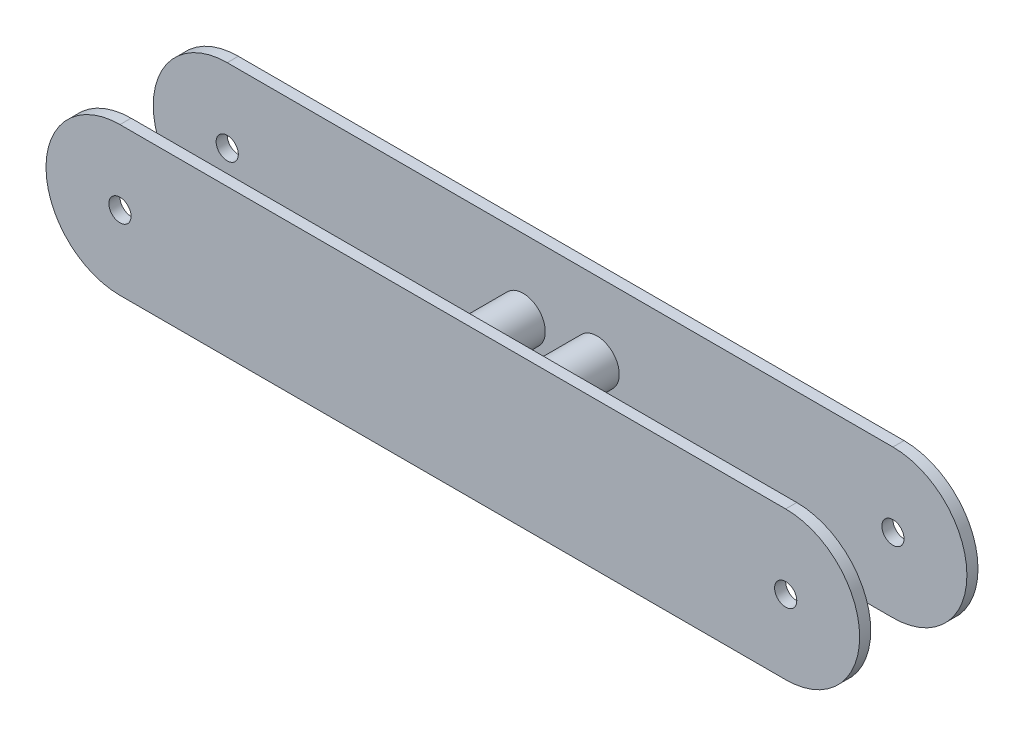
ISO-10303-21;
HEADER;
FILE_DESCRIPTION(('STEP AP214'),'2;1');
FILE_NAME('part.step','',(''),(''),'','','');
FILE_SCHEMA(('AUTOMOTIVE_DESIGN { 1 0 10303 214 1 1 1 1 }'));
ENDSEC;
DATA;
#1=APPLICATION_CONTEXT('core data for automotive mechanical design processes');
#2=APPLICATION_PROTOCOL_DEFINITION('international standard','automotive_design',2000,#1);
#3=PRODUCT_CONTEXT('',#1,'mechanical');
#4=PRODUCT('Part','Part','',(#3));
#5=PRODUCT_RELATED_PRODUCT_CATEGORY('part','',(#4));
#6=PRODUCT_DEFINITION_FORMATION('','',#4);
#7=PRODUCT_DEFINITION_CONTEXT('part definition',#1,'design');
#8=PRODUCT_DEFINITION('design','',#6,#7);
#9=PRODUCT_DEFINITION_SHAPE('','',#8);
#10=(LENGTH_UNIT() NAMED_UNIT(*) SI_UNIT(.MILLI.,.METRE.));
#11=(NAMED_UNIT(*) PLANE_ANGLE_UNIT() SI_UNIT($,.RADIAN.));
#12=(NAMED_UNIT(*) SI_UNIT($,.STERADIAN.) SOLID_ANGLE_UNIT());
#13=UNCERTAINTY_MEASURE_WITH_UNIT(LENGTH_MEASURE(1.E-05),#10,'distance_accuracy_value','');
#14=(GEOMETRIC_REPRESENTATION_CONTEXT(3) GLOBAL_UNCERTAINTY_ASSIGNED_CONTEXT((#13)) GLOBAL_UNIT_ASSIGNED_CONTEXT((#10,
#11,#12)) REPRESENTATION_CONTEXT('',''));
#15=CARTESIAN_POINT('',(0.,0.,0.));
#16=DIRECTION('',(0.,0.,1.));
#17=DIRECTION('',(1.,0.,0.));
#18=AXIS2_PLACEMENT_3D('',#15,#16,#17);
#19=CARTESIAN_POINT('',(36.2548733893554,-7.90045658926347,16.));
#20=DIRECTION('',(0.,0.,-1.));
#21=DIRECTION('',(-1.,0.,0.));
#22=AXIS2_PLACEMENT_3D('',#19,#20,#21);
#23=CYLINDRICAL_SURFACE('',#22,3.);
#24=CARTESIAN_POINT('',(36.2548733893554,-7.90045658926347,1.5));
#25=DIRECTION('',(0.,0.,-1.));
#26=DIRECTION('',(-1.,0.,0.));
#27=AXIS2_PLACEMENT_3D('',#24,#25,#26);
#28=CIRCLE('',#27,3.);
#29=CARTESIAN_POINT('',(33.2548733893554,-7.90045658926347,1.5));
#30=VERTEX_POINT('',#29);
#31=EDGE_CURVE('E173',#30,#30,#28,.T.);
#32=ORIENTED_EDGE('',*,*,#31,.F.);
#33=EDGE_LOOP('',(#32));
#34=FACE_BOUND('',#33,.T.);
#35=CARTESIAN_POINT('',(36.2548733893554,-7.90045658926347,14.5));
#36=DIRECTION('',(0.,0.,1.));
#37=DIRECTION('',(1.,0.,0.));
#38=AXIS2_PLACEMENT_3D('',#35,#36,#37);
#39=CIRCLE('',#38,3.);
#40=CARTESIAN_POINT('',(39.2548733893554,-7.90045658926347,14.5));
#41=VERTEX_POINT('',#40);
#42=EDGE_CURVE('E44',#41,#41,#39,.F.);
#43=ORIENTED_EDGE('',*,*,#42,.T.);
#44=EDGE_LOOP('',(#43));
#45=FACE_BOUND('',#44,.T.);
#46=ADVANCED_FACE('F40',(#34,#45),#23,.T.);
#47=CARTESIAN_POINT('',(-3.74512661064462,-7.90045658926347,16.));
#48=DIRECTION('',(0.,0.,-1.));
#49=DIRECTION('',(-1.,0.,0.));
#50=AXIS2_PLACEMENT_3D('',#47,#48,#49);
#51=CYLINDRICAL_SURFACE('',#50,10.);
#52=DIRECTION('',(0.,0.,-1.));
#53=VECTOR('',#52,1.);
#54=CARTESIAN_POINT('',(-3.74512661064462,-17.9004565892635,16.));
#55=LINE('',#54,#53);
#56=CARTESIAN_POINT('',(-3.74512661064462,-17.9004565892635,1.5));
#57=VERTEX_POINT('',#56);
#58=CARTESIAN_POINT('',(-3.74512661064462,-17.9004565892635,0.));
#59=VERTEX_POINT('',#58);
#60=EDGE_CURVE('E163',#57,#59,#55,.T.);
#61=ORIENTED_EDGE('',*,*,#60,.F.);
#62=CARTESIAN_POINT('',(-3.74512661064462,-7.90045658926347,1.5));
#63=DIRECTION('',(0.,0.,-1.));
#64=DIRECTION('',(-1.,0.,0.));
#65=AXIS2_PLACEMENT_3D('',#62,#63,#64);
#66=CIRCLE('',#65,10.);
#67=CARTESIAN_POINT('',(-3.74512661064462,2.09954341073653,1.5));
#68=VERTEX_POINT('',#67);
#69=EDGE_CURVE('E57',#57,#68,#66,.T.);
#70=ORIENTED_EDGE('',*,*,#69,.T.);
#71=DIRECTION('',(0.,0.,-1.));
#72=VECTOR('',#71,1.);
#73=CARTESIAN_POINT('',(-3.74512661064462,2.09954341073653,16.));
#74=LINE('',#73,#72);
#75=CARTESIAN_POINT('',(-3.74512661064462,2.09954341073653,0.));
#76=VERTEX_POINT('',#75);
#77=EDGE_CURVE('E167',#68,#76,#74,.T.);
#78=ORIENTED_EDGE('',*,*,#77,.T.);
#79=CARTESIAN_POINT('',(-3.74512661064462,-7.90045658926347,0.));
#80=DIRECTION('',(0.,0.,1.));
#81=DIRECTION('',(1.,0.,0.));
#82=AXIS2_PLACEMENT_3D('',#79,#80,#81);
#83=CIRCLE('',#82,10.);
#84=EDGE_CURVE('E164',#76,#59,#83,.T.);
#85=ORIENTED_EDGE('',*,*,#84,.T.);
#86=EDGE_LOOP('',(#61,#70,#78,#85));
#87=FACE_BOUND('',#86,.T.);
#88=ADVANCED_FACE('F235',(#87),#51,.T.);
#89=CARTESIAN_POINT('',(0.,-17.9004565892635,16.));
#90=DIRECTION('',(0.,1.,0.));
#91=DIRECTION('',(0.,0.,1.));
#92=AXIS2_PLACEMENT_3D('',#89,#90,#91);
#93=PLANE('',#92);
#94=DIRECTION('',(0.,0.,-1.));
#95=VECTOR('',#94,1.);
#96=CARTESIAN_POINT('',(86.2548733893554,-17.9004565892635,16.));
#97=LINE('',#96,#95);
#98=CARTESIAN_POINT('',(86.2548733893554,-17.9004565892635,1.5));
#99=VERTEX_POINT('',#98);
#100=CARTESIAN_POINT('',(86.2548733893554,-17.9004565892635,0.));
#101=VERTEX_POINT('',#100);
#102=EDGE_CURVE('E162',#99,#101,#97,.T.);
#103=ORIENTED_EDGE('',*,*,#102,.F.);
#104=DIRECTION('',(-1.,0.,0.));
#105=VECTOR('',#104,1.);
#106=CARTESIAN_POINT('',(0.,-17.9004565892635,1.5));
#107=LINE('',#106,#105);
#108=EDGE_CURVE('E66',#99,#57,#107,.T.);
#109=ORIENTED_EDGE('',*,*,#108,.T.);
#110=ORIENTED_EDGE('',*,*,#60,.T.);
#111=DIRECTION('',(1.,0.,0.));
#112=VECTOR('',#111,1.);
#113=CARTESIAN_POINT('',(0.,-17.9004565892635,0.));
#114=LINE('',#113,#112);
#115=EDGE_CURVE('E159',#59,#101,#114,.T.);
#116=ORIENTED_EDGE('',*,*,#115,.T.);
#117=EDGE_LOOP('',(#103,#109,#110,#116));
#118=FACE_BOUND('',#117,.T.);
#119=ADVANCED_FACE('F241',(#118),#93,.F.);
#120=CARTESIAN_POINT('',(86.2548733893554,-7.90045658926347,16.));
#121=DIRECTION('',(0.,0.,-1.));
#122=DIRECTION('',(-1.,0.,0.));
#123=AXIS2_PLACEMENT_3D('',#120,#121,#122);
#124=CYLINDRICAL_SURFACE('',#123,10.);
#125=CARTESIAN_POINT('',(86.2548733893554,-7.90045658926347,1.5));
#126=DIRECTION('',(0.,0.,-1.));
#127=DIRECTION('',(-1.,0.,0.));
#128=AXIS2_PLACEMENT_3D('',#125,#126,#127);
#129=CIRCLE('',#128,10.);
#130=CARTESIAN_POINT('',(86.2548733893554,2.09954341073653,1.5));
#131=VERTEX_POINT('',#130);
#132=EDGE_CURVE('E50',#99,#131,#129,.F.);
#133=ORIENTED_EDGE('',*,*,#132,.F.);
#134=ORIENTED_EDGE('',*,*,#102,.T.);
#135=CARTESIAN_POINT('',(86.2548733893554,-7.90045658926347,0.));
#136=DIRECTION('',(0.,0.,1.));
#137=DIRECTION('',(1.,0.,0.));
#138=AXIS2_PLACEMENT_3D('',#135,#136,#137);
#139=CIRCLE('',#138,10.);
#140=CARTESIAN_POINT('',(86.2548733893554,2.09954341073653,0.));
#141=VERTEX_POINT('',#140);
#142=EDGE_CURVE('E155',#141,#101,#139,.F.);
#143=ORIENTED_EDGE('',*,*,#142,.F.);
#144=DIRECTION('',(0.,0.,-1.));
#145=VECTOR('',#144,1.);
#146=CARTESIAN_POINT('',(86.2548733893554,2.09954341073653,16.));
#147=LINE('',#146,#145);
#148=EDGE_CURVE('E76',#131,#141,#147,.T.);
#149=ORIENTED_EDGE('',*,*,#148,.F.);
#150=EDGE_LOOP('',(#133,#134,#143,#149));
#151=FACE_BOUND('',#150,.T.);
#152=ADVANCED_FACE('F257',(#151),#124,.T.);
#153=CARTESIAN_POINT('',(0.,2.09954341073653,16.));
#154=DIRECTION('',(0.,1.,0.));
#155=DIRECTION('',(0.,0.,1.));
#156=AXIS2_PLACEMENT_3D('',#153,#154,#155);
#157=PLANE('',#156);
#158=DIRECTION('',(-1.,0.,0.));
#159=VECTOR('',#158,1.);
#160=CARTESIAN_POINT('',(-13.760546258516,2.09954341073653,1.5));
#161=LINE('',#160,#159);
#162=EDGE_CURVE('E11',#131,#68,#161,.T.);
#163=ORIENTED_EDGE('',*,*,#162,.F.);
#164=ORIENTED_EDGE('',*,*,#148,.T.);
#165=DIRECTION('',(1.,0.,0.));
#166=VECTOR('',#165,1.);
#167=CARTESIAN_POINT('',(0.,2.09954341073653,0.));
#168=LINE('',#167,#166);
#169=EDGE_CURVE('E152',#76,#141,#168,.T.);
#170=ORIENTED_EDGE('',*,*,#169,.F.);
#171=ORIENTED_EDGE('',*,*,#77,.F.);
#172=EDGE_LOOP('',(#163,#164,#170,#171));
#173=FACE_BOUND('',#172,.T.);
#174=ADVANCED_FACE('F253',(#173),#157,.T.);
#175=CARTESIAN_POINT('',(86.2548733893554,-7.90045658926347,0.));
#176=DIRECTION('',(0.,0.,1.));
#177=DIRECTION('',(1.,0.,0.));
#178=AXIS2_PLACEMENT_3D('',#175,#176,#177);
#179=CYLINDRICAL_SURFACE('',#178,1.5);
#180=CARTESIAN_POINT('',(86.2548733893554,-7.90045658926347,1.5));
#181=DIRECTION('',(0.,0.,-1.));
#182=DIRECTION('',(-1.,0.,0.));
#183=AXIS2_PLACEMENT_3D('',#180,#181,#182);
#184=CIRCLE('',#183,1.5);
#185=CARTESIAN_POINT('',(84.7548733893554,-7.90045658926347,1.5));
#186=VERTEX_POINT('',#185);
#187=EDGE_CURVE('E151',#186,#186,#184,.F.);
#188=ORIENTED_EDGE('',*,*,#187,.T.);
#189=EDGE_LOOP('',(#188));
#190=FACE_BOUND('',#189,.T.);
#191=CARTESIAN_POINT('',(86.2548733893554,-7.90045658926347,0.));
#192=DIRECTION('',(0.,0.,1.));
#193=DIRECTION('',(1.,0.,0.));
#194=AXIS2_PLACEMENT_3D('',#191,#192,#193);
#195=CIRCLE('',#194,1.5);
#196=CARTESIAN_POINT('',(87.7548733893554,-7.90045658926347,0.));
#197=VERTEX_POINT('',#196);
#198=EDGE_CURVE('E156',#197,#197,#195,.T.);
#199=ORIENTED_EDGE('',*,*,#198,.F.);
#200=EDGE_LOOP('',(#199));
#201=FACE_BOUND('',#200,.T.);
#202=ADVANCED_FACE('F256',(#190,#201),#179,.F.);
#203=CARTESIAN_POINT('',(-3.74512661064462,-7.90045658926347,0.));
#204=DIRECTION('',(0.,0.,1.));
#205=DIRECTION('',(1.,0.,0.));
#206=AXIS2_PLACEMENT_3D('',#203,#204,#205);
#207=CYLINDRICAL_SURFACE('',#206,1.5);
#208=CARTESIAN_POINT('',(-3.74512661064462,-7.90045658926347,1.5));
#209=DIRECTION('',(0.,0.,-1.));
#210=DIRECTION('',(-1.,0.,0.));
#211=AXIS2_PLACEMENT_3D('',#208,#209,#210);
#212=CIRCLE('',#211,1.5);
#213=CARTESIAN_POINT('',(-5.24512661064462,-7.90045658926347,1.5));
#214=VERTEX_POINT('',#213);
#215=EDGE_CURVE('E147',#214,#214,#212,.F.);
#216=ORIENTED_EDGE('',*,*,#215,.T.);
#217=EDGE_LOOP('',(#216));
#218=FACE_BOUND('',#217,.T.);
#219=CARTESIAN_POINT('',(-3.74512661064462,-7.90045658926347,0.));
#220=DIRECTION('',(0.,0.,1.));
#221=DIRECTION('',(1.,0.,0.));
#222=AXIS2_PLACEMENT_3D('',#219,#220,#221);
#223=CIRCLE('',#222,1.5);
#224=CARTESIAN_POINT('',(-2.24512661064462,-7.90045658926347,0.));
#225=VERTEX_POINT('',#224);
#226=EDGE_CURVE('E150',#225,#225,#223,.T.);
#227=ORIENTED_EDGE('',*,*,#226,.F.);
#228=EDGE_LOOP('',(#227));
#229=FACE_BOUND('',#228,.T.);
#230=ADVANCED_FACE('F42',(#218,#229),#207,.F.);
#231=CARTESIAN_POINT('',(0.,0.,0.));
#232=DIRECTION('',(0.,0.,1.));
#233=DIRECTION('',(1.,0.,0.));
#234=AXIS2_PLACEMENT_3D('',#231,#232,#233);
#235=PLANE('',#234);
#236=ORIENTED_EDGE('',*,*,#226,.T.);
#237=EDGE_LOOP('',(#236));
#238=FACE_BOUND('',#237,.T.);
#239=ORIENTED_EDGE('',*,*,#198,.T.);
#240=EDGE_LOOP('',(#239));
#241=FACE_BOUND('',#240,.T.);
#242=ORIENTED_EDGE('',*,*,#84,.F.);
#243=ORIENTED_EDGE('',*,*,#169,.T.);
#244=ORIENTED_EDGE('',*,*,#142,.T.);
#245=ORIENTED_EDGE('',*,*,#115,.F.);
#246=EDGE_LOOP('',(#242,#243,#244,#245));
#247=FACE_BOUND('',#246,.T.);
#248=ADVANCED_FACE('F245',(#238,#241,#247),#235,.F.);
#249=CARTESIAN_POINT('',(-13.760546258516,-20.9004565892635,1.5));
#250=DIRECTION('',(0.,0.,-1.));
#251=DIRECTION('',(-1.,0.,0.));
#252=AXIS2_PLACEMENT_3D('',#249,#250,#251);
#253=PLANE('',#252);
#254=CARTESIAN_POINT('',(46.2548733893554,-7.90045658926347,1.5));
#255=DIRECTION('',(0.,0.,-1.));
#256=DIRECTION('',(-1.,0.,0.));
#257=AXIS2_PLACEMENT_3D('',#254,#255,#256);
#258=CIRCLE('',#257,3.);
#259=CARTESIAN_POINT('',(43.2548733893554,-7.90045658926347,1.5));
#260=VERTEX_POINT('',#259);
#261=EDGE_CURVE('E119',#260,#260,#258,.T.);
#262=ORIENTED_EDGE('',*,*,#261,.T.);
#263=EDGE_LOOP('',(#262));
#264=FACE_BOUND('',#263,.T.);
#265=ORIENTED_EDGE('',*,*,#31,.T.);
#266=EDGE_LOOP('',(#265));
#267=FACE_BOUND('',#266,.T.);
#268=ORIENTED_EDGE('',*,*,#215,.F.);
#269=EDGE_LOOP('',(#268));
#270=FACE_BOUND('',#269,.T.);
#271=ORIENTED_EDGE('',*,*,#187,.F.);
#272=EDGE_LOOP('',(#271));
#273=FACE_BOUND('',#272,.T.);
#274=ORIENTED_EDGE('',*,*,#108,.F.);
#275=ORIENTED_EDGE('',*,*,#132,.T.);
#276=ORIENTED_EDGE('',*,*,#162,.T.);
#277=ORIENTED_EDGE('',*,*,#69,.F.);
#278=EDGE_LOOP('',(#274,#275,#276,#277));
#279=FACE_BOUND('',#278,.T.);
#280=ADVANCED_FACE('F248',(#264,#267,#270,#273,#279),#253,.F.);
#281=CARTESIAN_POINT('',(0.,2.09954341073653,16.));
#282=DIRECTION('',(0.,1.,0.));
#283=DIRECTION('',(0.,0.,1.));
#284=AXIS2_PLACEMENT_3D('',#281,#282,#283);
#285=PLANE('',#284);
#286=DIRECTION('',(1.,0.,0.));
#287=VECTOR('',#286,1.);
#288=CARTESIAN_POINT('',(-13.760546258516,2.09954341073653,14.5));
#289=LINE('',#288,#287);
#290=CARTESIAN_POINT('',(-3.74512661064462,2.09954341073653,14.5));
#291=VERTEX_POINT('',#290);
#292=CARTESIAN_POINT('',(86.2548733893554,2.09954341073653,14.5));
#293=VERTEX_POINT('',#292);
#294=EDGE_CURVE('E108',#291,#293,#289,.T.);
#295=ORIENTED_EDGE('',*,*,#294,.F.);
#296=DIRECTION('',(0.,0.,-1.));
#297=VECTOR('',#296,1.);
#298=CARTESIAN_POINT('',(-3.74512661064462,2.09954341073653,16.));
#299=LINE('',#298,#297);
#300=CARTESIAN_POINT('',(-3.74512661064462,2.09954341073653,16.));
#301=VERTEX_POINT('',#300);
#302=EDGE_CURVE('E136',#301,#291,#299,.T.);
#303=ORIENTED_EDGE('',*,*,#302,.F.);
#304=DIRECTION('',(1.,0.,0.));
#305=VECTOR('',#304,1.);
#306=CARTESIAN_POINT('',(0.,2.09954341073653,16.));
#307=LINE('',#306,#305);
#308=CARTESIAN_POINT('',(86.2548733893554,2.09954341073653,16.));
#309=VERTEX_POINT('',#308);
#310=EDGE_CURVE('E135',#301,#309,#307,.T.);
#311=ORIENTED_EDGE('',*,*,#310,.T.);
#312=DIRECTION('',(0.,0.,-1.));
#313=VECTOR('',#312,1.);
#314=CARTESIAN_POINT('',(86.2548733893554,2.09954341073653,16.));
#315=LINE('',#314,#313);
#316=EDGE_CURVE('E125',#309,#293,#315,.T.);
#317=ORIENTED_EDGE('',*,*,#316,.T.);
#318=EDGE_LOOP('',(#295,#303,#311,#317));
#319=FACE_BOUND('',#318,.T.);
#320=ADVANCED_FACE('F133',(#319),#285,.T.);
#321=CARTESIAN_POINT('',(86.2548733893554,-7.90045658926347,16.));
#322=DIRECTION('',(0.,0.,-1.));
#323=DIRECTION('',(-1.,0.,0.));
#324=AXIS2_PLACEMENT_3D('',#321,#322,#323);
#325=CYLINDRICAL_SURFACE('',#324,10.);
#326=CARTESIAN_POINT('',(86.2548733893554,-7.90045658926347,14.5));
#327=DIRECTION('',(0.,0.,1.));
#328=DIRECTION('',(1.,0.,0.));
#329=AXIS2_PLACEMENT_3D('',#326,#327,#328);
#330=CIRCLE('',#329,10.);
#331=CARTESIAN_POINT('',(86.2548733893554,-17.9004565892635,14.5));
#332=VERTEX_POINT('',#331);
#333=EDGE_CURVE('E111',#293,#332,#330,.F.);
#334=ORIENTED_EDGE('',*,*,#333,.F.);
#335=ORIENTED_EDGE('',*,*,#316,.F.);
#336=CARTESIAN_POINT('',(86.2548733893554,-7.90045658926347,16.));
#337=DIRECTION('',(0.,0.,1.));
#338=DIRECTION('',(1.,0.,0.));
#339=AXIS2_PLACEMENT_3D('',#336,#337,#338);
#340=CIRCLE('',#339,10.);
#341=CARTESIAN_POINT('',(86.2548733893554,-17.9004565892635,16.));
#342=VERTEX_POINT('',#341);
#343=EDGE_CURVE('E216',#309,#342,#340,.F.);
#344=ORIENTED_EDGE('',*,*,#343,.T.);
#345=DIRECTION('',(0.,0.,-1.));
#346=VECTOR('',#345,1.);
#347=CARTESIAN_POINT('',(86.2548733893554,-17.9004565892635,16.));
#348=LINE('',#347,#346);
#349=EDGE_CURVE('E128',#342,#332,#348,.T.);
#350=ORIENTED_EDGE('',*,*,#349,.T.);
#351=EDGE_LOOP('',(#334,#335,#344,#350));
#352=FACE_BOUND('',#351,.T.);
#353=ADVANCED_FACE('F123',(#352),#325,.T.);
#354=CARTESIAN_POINT('',(0.,-17.9004565892635,16.));
#355=DIRECTION('',(0.,1.,0.));
#356=DIRECTION('',(0.,0.,1.));
#357=AXIS2_PLACEMENT_3D('',#354,#355,#356);
#358=PLANE('',#357);
#359=DIRECTION('',(0.,0.,-1.));
#360=VECTOR('',#359,1.);
#361=CARTESIAN_POINT('',(-3.74512661064462,-17.9004565892635,16.));
#362=LINE('',#361,#360);
#363=CARTESIAN_POINT('',(-3.74512661064462,-17.9004565892635,16.));
#364=VERTEX_POINT('',#363);
#365=CARTESIAN_POINT('',(-3.74512661064462,-17.9004565892635,14.5));
#366=VERTEX_POINT('',#365);
#367=EDGE_CURVE('E138',#364,#366,#362,.T.);
#368=ORIENTED_EDGE('',*,*,#367,.T.);
#369=DIRECTION('',(1.,0.,0.));
#370=VECTOR('',#369,1.);
#371=CARTESIAN_POINT('',(0.,-17.9004565892635,14.5));
#372=LINE('',#371,#370);
#373=EDGE_CURVE('E129',#366,#332,#372,.T.);
#374=ORIENTED_EDGE('',*,*,#373,.T.);
#375=ORIENTED_EDGE('',*,*,#349,.F.);
#376=DIRECTION('',(1.,0.,0.));
#377=VECTOR('',#376,1.);
#378=CARTESIAN_POINT('',(0.,-17.9004565892635,16.));
#379=LINE('',#378,#377);
#380=EDGE_CURVE('E214',#364,#342,#379,.T.);
#381=ORIENTED_EDGE('',*,*,#380,.F.);
#382=EDGE_LOOP('',(#368,#374,#375,#381));
#383=FACE_BOUND('',#382,.T.);
#384=ADVANCED_FACE('F221',(#383),#358,.F.);
#385=CARTESIAN_POINT('',(-3.74512661064462,-7.90045658926347,16.));
#386=DIRECTION('',(0.,0.,-1.));
#387=DIRECTION('',(-1.,0.,0.));
#388=AXIS2_PLACEMENT_3D('',#385,#386,#387);
#389=CYLINDRICAL_SURFACE('',#388,10.);
#390=ORIENTED_EDGE('',*,*,#302,.T.);
#391=CARTESIAN_POINT('',(-3.74512661064462,-7.90045658926347,14.5));
#392=DIRECTION('',(0.,0.,1.));
#393=DIRECTION('',(1.,0.,0.));
#394=AXIS2_PLACEMENT_3D('',#391,#392,#393);
#395=CIRCLE('',#394,10.);
#396=EDGE_CURVE('E114',#291,#366,#395,.T.);
#397=ORIENTED_EDGE('',*,*,#396,.T.);
#398=ORIENTED_EDGE('',*,*,#367,.F.);
#399=CARTESIAN_POINT('',(-3.74512661064462,-7.90045658926347,16.));
#400=DIRECTION('',(0.,0.,1.));
#401=DIRECTION('',(1.,0.,0.));
#402=AXIS2_PLACEMENT_3D('',#399,#400,#401);
#403=CIRCLE('',#402,10.);
#404=EDGE_CURVE('E209',#301,#364,#403,.T.);
#405=ORIENTED_EDGE('',*,*,#404,.F.);
#406=EDGE_LOOP('',(#390,#397,#398,#405));
#407=FACE_BOUND('',#406,.T.);
#408=ADVANCED_FACE('F223',(#407),#389,.T.);
#409=CARTESIAN_POINT('',(86.2548733893554,-7.90045658926347,0.));
#410=DIRECTION('',(0.,0.,1.));
#411=DIRECTION('',(1.,0.,0.));
#412=AXIS2_PLACEMENT_3D('',#409,#410,#411);
#413=CYLINDRICAL_SURFACE('',#412,1.5);
#414=CARTESIAN_POINT('',(86.2548733893554,-7.90045658926347,14.5));
#415=DIRECTION('',(0.,0.,1.));
#416=DIRECTION('',(1.,0.,0.));
#417=AXIS2_PLACEMENT_3D('',#414,#415,#416);
#418=CIRCLE('',#417,1.5);
#419=CARTESIAN_POINT('',(87.7548733893554,-7.90045658926347,14.5));
#420=VERTEX_POINT('',#419);
#421=EDGE_CURVE('E130',#420,#420,#418,.F.);
#422=ORIENTED_EDGE('',*,*,#421,.T.);
#423=EDGE_LOOP('',(#422));
#424=FACE_BOUND('',#423,.T.);
#425=CARTESIAN_POINT('',(86.2548733893554,-7.90045658926347,16.));
#426=DIRECTION('',(0.,0.,1.));
#427=DIRECTION('',(1.,0.,0.));
#428=AXIS2_PLACEMENT_3D('',#425,#426,#427);
#429=CIRCLE('',#428,1.5);
#430=CARTESIAN_POINT('',(87.7548733893554,-7.90045658926347,16.));
#431=VERTEX_POINT('',#430);
#432=EDGE_CURVE('E205',#431,#431,#429,.T.);
#433=ORIENTED_EDGE('',*,*,#432,.T.);
#434=EDGE_LOOP('',(#433));
#435=FACE_BOUND('',#434,.T.);
#436=ADVANCED_FACE('F225',(#424,#435),#413,.F.);
#437=CARTESIAN_POINT('',(-3.74512661064462,-7.90045658926347,0.));
#438=DIRECTION('',(0.,0.,1.));
#439=DIRECTION('',(1.,0.,0.));
#440=AXIS2_PLACEMENT_3D('',#437,#438,#439);
#441=CYLINDRICAL_SURFACE('',#440,1.5);
#442=CARTESIAN_POINT('',(-3.74512661064462,-7.90045658926347,14.5));
#443=DIRECTION('',(0.,0.,1.));
#444=DIRECTION('',(1.,0.,0.));
#445=AXIS2_PLACEMENT_3D('',#442,#443,#444);
#446=CIRCLE('',#445,1.5);
#447=CARTESIAN_POINT('',(-2.24512661064462,-7.90045658926347,14.5));
#448=VERTEX_POINT('',#447);
#449=EDGE_CURVE('E118',#448,#448,#446,.F.);
#450=ORIENTED_EDGE('',*,*,#449,.T.);
#451=EDGE_LOOP('',(#450));
#452=FACE_BOUND('',#451,.T.);
#453=CARTESIAN_POINT('',(-3.74512661064462,-7.90045658926347,16.));
#454=DIRECTION('',(0.,0.,1.));
#455=DIRECTION('',(1.,0.,0.));
#456=AXIS2_PLACEMENT_3D('',#453,#454,#455);
#457=CIRCLE('',#456,1.5);
#458=CARTESIAN_POINT('',(-2.24512661064462,-7.90045658926347,16.));
#459=VERTEX_POINT('',#458);
#460=EDGE_CURVE('E206',#459,#459,#457,.T.);
#461=ORIENTED_EDGE('',*,*,#460,.T.);
#462=EDGE_LOOP('',(#461));
#463=FACE_BOUND('',#462,.T.);
#464=ADVANCED_FACE('F192',(#452,#463),#441,.F.);
#465=CARTESIAN_POINT('',(-13.760546258516,-20.9004565892635,14.5));
#466=DIRECTION('',(0.,0.,1.));
#467=DIRECTION('',(1.,0.,0.));
#468=AXIS2_PLACEMENT_3D('',#465,#466,#467);
#469=PLANE('',#468);
#470=CARTESIAN_POINT('',(46.2548733893554,-7.90045658926347,14.5));
#471=DIRECTION('',(0.,0.,1.));
#472=DIRECTION('',(1.,0.,0.));
#473=AXIS2_PLACEMENT_3D('',#470,#471,#472);
#474=CIRCLE('',#473,3.);
#475=CARTESIAN_POINT('',(49.2548733893554,-7.90045658926347,14.5));
#476=VERTEX_POINT('',#475);
#477=EDGE_CURVE('E363',#476,#476,#474,.T.);
#478=ORIENTED_EDGE('',*,*,#477,.T.);
#479=EDGE_LOOP('',(#478));
#480=FACE_BOUND('',#479,.T.);
#481=ORIENTED_EDGE('',*,*,#42,.F.);
#482=EDGE_LOOP('',(#481));
#483=FACE_BOUND('',#482,.T.);
#484=ORIENTED_EDGE('',*,*,#449,.F.);
#485=EDGE_LOOP('',(#484));
#486=FACE_BOUND('',#485,.T.);
#487=ORIENTED_EDGE('',*,*,#421,.F.);
#488=EDGE_LOOP('',(#487));
#489=FACE_BOUND('',#488,.T.);
#490=ORIENTED_EDGE('',*,*,#294,.T.);
#491=ORIENTED_EDGE('',*,*,#333,.T.);
#492=ORIENTED_EDGE('',*,*,#373,.F.);
#493=ORIENTED_EDGE('',*,*,#396,.F.);
#494=EDGE_LOOP('',(#490,#491,#492,#493));
#495=FACE_BOUND('',#494,.T.);
#496=ADVANCED_FACE('F110',(#480,#483,#486,#489,#495),#469,.F.);
#497=CARTESIAN_POINT('',(36.2548733893554,-7.90045658926347,16.));
#498=DIRECTION('',(0.,0.,-1.));
#499=DIRECTION('',(-1.,0.,0.));
#500=AXIS2_PLACEMENT_3D('',#497,#498,#499);
#501=PLANE('',#500);
#502=ORIENTED_EDGE('',*,*,#460,.F.);
#503=EDGE_LOOP('',(#502));
#504=FACE_BOUND('',#503,.T.);
#505=ORIENTED_EDGE('',*,*,#432,.F.);
#506=EDGE_LOOP('',(#505));
#507=FACE_BOUND('',#506,.T.);
#508=ORIENTED_EDGE('',*,*,#404,.T.);
#509=ORIENTED_EDGE('',*,*,#380,.T.);
#510=ORIENTED_EDGE('',*,*,#343,.F.);
#511=ORIENTED_EDGE('',*,*,#310,.F.);
#512=EDGE_LOOP('',(#508,#509,#510,#511));
#513=FACE_BOUND('',#512,.T.);
#514=ADVANCED_FACE('F191',(#504,#507,#513),#501,.F.);
#515=CARTESIAN_POINT('',(46.2548733893554,-7.90045658926347,16.));
#516=DIRECTION('',(0.,0.,-1.));
#517=DIRECTION('',(-1.,0.,0.));
#518=AXIS2_PLACEMENT_3D('',#515,#516,#517);
#519=CYLINDRICAL_SURFACE('',#518,3.);
#520=ORIENTED_EDGE('',*,*,#477,.F.);
#521=EDGE_LOOP('',(#520));
#522=FACE_BOUND('',#521,.T.);
#523=ORIENTED_EDGE('',*,*,#261,.F.);
#524=EDGE_LOOP('',(#523));
#525=FACE_BOUND('',#524,.T.);
#526=ADVANCED_FACE('F345',(#522,#525),#519,.T.);
#527=CLOSED_SHELL('',(#46,#88,#119,#152,#174,#202,#230,#248,#280,#320,#353,#384,#408,#436,#464,
#496,#514,#526));
#528=MANIFOLD_SOLID_BREP('B2',#527);
#529=ADVANCED_BREP_SHAPE_REPRESENTATION('',(#18,#528),#14);
#530=SHAPE_DEFINITION_REPRESENTATION(#9,#529);
ENDSEC;
END-ISO-10303-21;
